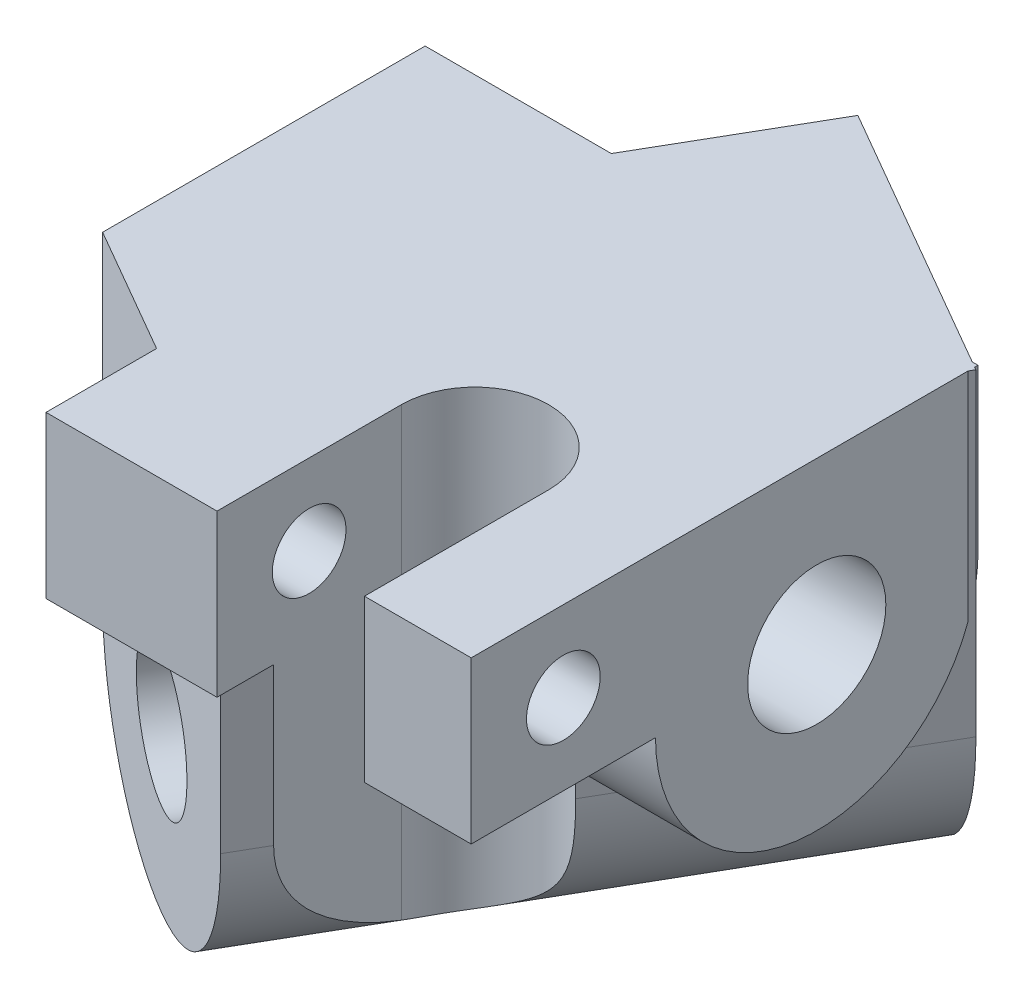
ISO-10303-21;
HEADER;
FILE_DESCRIPTION(('STEP AP214'),'2;1');
FILE_NAME('part.step','',(''),(''),'','','');
FILE_SCHEMA(('AUTOMOTIVE_DESIGN { 1 0 10303 214 1 1 1 1 }'));
ENDSEC;
DATA;
#1=APPLICATION_CONTEXT('core data for automotive mechanical design processes');
#2=APPLICATION_PROTOCOL_DEFINITION('international standard','automotive_design',2000,#1);
#3=PRODUCT_CONTEXT('',#1,'mechanical');
#4=PRODUCT('Part','Part','',(#3));
#5=PRODUCT_RELATED_PRODUCT_CATEGORY('part','',(#4));
#6=PRODUCT_DEFINITION_FORMATION('','',#4);
#7=PRODUCT_DEFINITION_CONTEXT('part definition',#1,'design');
#8=PRODUCT_DEFINITION('design','',#6,#7);
#9=PRODUCT_DEFINITION_SHAPE('','',#8);
#10=(LENGTH_UNIT() NAMED_UNIT(*) SI_UNIT(.MILLI.,.METRE.));
#11=(NAMED_UNIT(*) PLANE_ANGLE_UNIT() SI_UNIT($,.RADIAN.));
#12=(NAMED_UNIT(*) SI_UNIT($,.STERADIAN.) SOLID_ANGLE_UNIT());
#13=UNCERTAINTY_MEASURE_WITH_UNIT(LENGTH_MEASURE(1.E-05),#10,'distance_accuracy_value','');
#14=(GEOMETRIC_REPRESENTATION_CONTEXT(3) GLOBAL_UNCERTAINTY_ASSIGNED_CONTEXT((#13)) GLOBAL_UNIT_ASSIGNED_CONTEXT((#10,
#11,#12)) REPRESENTATION_CONTEXT('',''));
#15=CARTESIAN_POINT('',(0.,0.,0.));
#16=DIRECTION('',(0.,0.,1.));
#17=DIRECTION('',(1.,0.,0.));
#18=AXIS2_PLACEMENT_3D('',#15,#16,#17);
#19=CARTESIAN_POINT('',(30.1554445662278,-17.25,-8.48076211353301));
#20=DIRECTION('',(-0.866025403784436,0.,-0.500000000000004));
#21=DIRECTION('',(-0.500000000000004,0.,0.866025403784436));
#22=AXIS2_PLACEMENT_3D('',#19,#20,#21);
#23=PLANE('',#22);
#24=DIRECTION('',(-0.500000000000004,0.,0.866025403784436));
#25=VECTOR('',#24,1.);
#26=CARTESIAN_POINT('',(30.1554445662278,-17.25,-8.48076211353301));
#27=LINE('',#26,#25);
#28=CARTESIAN_POINT('',(24.0601163962181,-17.25,2.07665596572951));
#29=VERTEX_POINT('',#28);
#30=CARTESIAN_POINT('',(22.207259421637,-17.25,5.28589838486226));
#31=VERTEX_POINT('',#30);
#32=EDGE_CURVE('E425',#29,#31,#27,.T.);
#33=ORIENTED_EDGE('',*,*,#32,.F.);
#34=CARTESIAN_POINT('',(25.2590742770462,-8.75,0.));
#35=DIRECTION('',(0.866025403784436,0.,0.500000000000004));
#36=DIRECTION('',(-0.500000000000004,0.,0.866025403784436));
#37=AXIS2_PLACEMENT_3D('',#34,#35,#36);
#38=ELLIPSE('',#37,10.1036297108185,8.75);
#39=CARTESIAN_POINT('',(22.207259421637,-15.7229318270661,5.28589838486226));
#40=VERTEX_POINT('',#39);
#41=EDGE_CURVE('E429',#40,#29,#38,.T.);
#42=ORIENTED_EDGE('',*,*,#41,.F.);
#43=DIRECTION('',(0.,1.,0.));
#44=VECTOR('',#43,1.);
#45=CARTESIAN_POINT('',(22.207259421637,-26.,5.28589838486226));
#46=LINE('',#45,#44);
#47=EDGE_CURVE('E40',#31,#40,#46,.T.);
#48=ORIENTED_EDGE('',*,*,#47,.F.);
#49=EDGE_LOOP('',(#33,#42,#48));
#50=FACE_BOUND('',#49,.T.);
#51=ADVANCED_FACE('F32',(#50),#23,.F.);
#52=CARTESIAN_POINT('',(30.,-8.75,0.));
#53=DIRECTION('',(1.,0.,0.));
#54=DIRECTION('',(0.,0.,-1.));
#55=AXIS2_PLACEMENT_3D('',#52,#53,#54);
#56=PLANE('',#55);
#57=CARTESIAN_POINT('',(30.,-4.375,13.75));
#58=DIRECTION('',(-1.,0.,0.));
#59=DIRECTION('',(0.,0.,-1.));
#60=AXIS2_PLACEMENT_3D('',#57,#58,#59);
#61=CIRCLE('',#60,2.);
#62=CARTESIAN_POINT('',(30.,-4.375,11.75));
#63=VERTEX_POINT('',#62);
#64=EDGE_CURVE('E196',#63,#63,#61,.T.);
#65=ORIENTED_EDGE('',*,*,#64,.T.);
#66=EDGE_LOOP('',(#65));
#67=FACE_BOUND('',#66,.T.);
#68=CARTESIAN_POINT('',(30.,-8.75,0.));
#69=DIRECTION('',(-1.,0.,0.));
#70=DIRECTION('',(0.,0.,-1.));
#71=AXIS2_PLACEMENT_3D('',#68,#69,#70);
#72=CIRCLE('',#71,3.75);
#73=CARTESIAN_POINT('',(30.,-8.75,-3.75));
#74=VERTEX_POINT('',#73);
#75=EDGE_CURVE('E368',#74,#74,#72,.T.);
#76=ORIENTED_EDGE('',*,*,#75,.T.);
#77=EDGE_LOOP('',(#76));
#78=FACE_BOUND('',#77,.T.);
#79=DIRECTION('',(0.,0.,-1.));
#80=VECTOR('',#79,1.);
#81=CARTESIAN_POINT('',(30.,0.,8.75));
#82=LINE('',#81,#80);
#83=CARTESIAN_POINT('',(30.,0.,18.75));
#84=VERTEX_POINT('',#83);
#85=CARTESIAN_POINT('',(30.,0.,-8.21152422706606));
#86=VERTEX_POINT('',#85);
#87=EDGE_CURVE('E360',#84,#86,#82,.T.);
#88=ORIENTED_EDGE('',*,*,#87,.F.);
#89=DIRECTION('',(0.,1.,0.));
#90=VECTOR('',#89,1.);
#91=CARTESIAN_POINT('',(30.,-8.75,18.75));
#92=LINE('',#91,#90);
#93=CARTESIAN_POINT('',(30.,-8.75,18.75));
#94=VERTEX_POINT('',#93);
#95=EDGE_CURVE('E225',#94,#84,#92,.T.);
#96=ORIENTED_EDGE('',*,*,#95,.F.);
#97=DIRECTION('',(0.,0.,1.));
#98=VECTOR('',#97,1.);
#99=CARTESIAN_POINT('',(30.,-8.75,18.75));
#100=LINE('',#99,#98);
#101=CARTESIAN_POINT('',(30.,-8.75,8.75));
#102=VERTEX_POINT('',#101);
#103=EDGE_CURVE('E217',#102,#94,#100,.T.);
#104=ORIENTED_EDGE('',*,*,#103,.F.);
#105=CARTESIAN_POINT('',(30.,-8.75,0.));
#106=DIRECTION('',(-1.,0.,0.));
#107=DIRECTION('',(0.,0.,-1.));
#108=AXIS2_PLACEMENT_3D('',#105,#106,#107);
#109=CIRCLE('',#108,8.75);
#110=CARTESIAN_POINT('',(30.,-11.772146566318,-8.21152422706604));
#111=VERTEX_POINT('',#110);
#112=EDGE_CURVE('E351',#111,#102,#109,.T.);
#113=ORIENTED_EDGE('',*,*,#112,.F.);
#114=DIRECTION('',(0.,-1.,0.));
#115=VECTOR('',#114,1.);
#116=CARTESIAN_POINT('',(30.,-8.75000000000001,-8.21152422706605));
#117=LINE('',#116,#115);
#118=EDGE_CURVE('E337',#86,#111,#117,.T.);
#119=ORIENTED_EDGE('',*,*,#118,.F.);
#120=EDGE_LOOP('',(#88,#96,#104,#113,#119));
#121=FACE_BOUND('',#120,.T.);
#122=ADVANCED_FACE('F311',(#67,#78,#121),#56,.T.);
#123=CARTESIAN_POINT('',(30.,0.,-8.75));
#124=DIRECTION('',(0.,0.,1.));
#125=DIRECTION('',(1.,0.,0.));
#126=AXIS2_PLACEMENT_3D('',#123,#124,#125);
#127=PLANE('',#126);
#128=DIRECTION('',(0.,-1.,0.));
#129=VECTOR('',#128,1.);
#130=CARTESIAN_POINT('',(10.1036297108186,0.,-8.75));
#131=LINE('',#130,#129);
#132=CARTESIAN_POINT('',(10.1036297108186,0.,-8.75));
#133=VERTEX_POINT('',#132);
#134=CARTESIAN_POINT('',(10.1036297108186,-8.75,-8.75));
#135=VERTEX_POINT('',#134);
#136=EDGE_CURVE('E434',#133,#135,#131,.T.);
#137=ORIENTED_EDGE('',*,*,#136,.T.);
#138=DIRECTION('',(-1.,0.,0.));
#139=VECTOR('',#138,1.);
#140=CARTESIAN_POINT('',(30.,-8.75,-8.75));
#141=LINE('',#140,#139);
#142=CARTESIAN_POINT('',(0.,-8.75,-8.75));
#143=VERTEX_POINT('',#142);
#144=EDGE_CURVE('E378',#135,#143,#141,.T.);
#145=ORIENTED_EDGE('',*,*,#144,.T.);
#146=DIRECTION('',(0.,-1.,0.));
#147=VECTOR('',#146,1.);
#148=CARTESIAN_POINT('',(0.,0.,-8.75));
#149=LINE('',#148,#147);
#150=CARTESIAN_POINT('',(0.,0.,-8.75));
#151=VERTEX_POINT('',#150);
#152=EDGE_CURVE('E370',#151,#143,#149,.T.);
#153=ORIENTED_EDGE('',*,*,#152,.F.);
#154=DIRECTION('',(-1.,0.,0.));
#155=VECTOR('',#154,1.);
#156=CARTESIAN_POINT('',(30.,0.,-8.75));
#157=LINE('',#156,#155);
#158=EDGE_CURVE('E381',#133,#151,#157,.T.);
#159=ORIENTED_EDGE('',*,*,#158,.F.);
#160=EDGE_LOOP('',(#137,#145,#153,#159));
#161=FACE_BOUND('',#160,.T.);
#162=ADVANCED_FACE('F297',(#161),#127,.F.);
#163=CARTESIAN_POINT('',(30.,-8.75,0.));
#164=DIRECTION('',(-1.,0.,0.));
#165=DIRECTION('',(0.,0.,1.));
#166=AXIS2_PLACEMENT_3D('',#163,#164,#165);
#167=CYLINDRICAL_SURFACE('',#166,8.75);
#168=CARTESIAN_POINT('',(5.05181485540928,-8.75,0.));
#169=DIRECTION('',(-0.866025403784436,0.,-0.500000000000004));
#170=DIRECTION('',(-0.500000000000004,0.,0.866025403784436));
#171=AXIS2_PLACEMENT_3D('',#168,#169,#170);
#172=ELLIPSE('',#171,10.1036297108185,8.75);
#173=CARTESIAN_POINT('',(6.25077273623748,-17.25,-2.07665596572953));
#174=VERTEX_POINT('',#173);
#175=EDGE_CURVE('E433',#135,#174,#172,.T.);
#176=ORIENTED_EDGE('',*,*,#175,.T.);
#177=CARTESIAN_POINT('',(6.25077273623748,-17.25,-2.07665596572953));
#178=CARTESIAN_POINT('',(6.17045305423663,-17.2839955158162,-1.93752118965594));
#179=CARTESIAN_POINT('',(6.08992669708827,-17.3145407726905,-1.79766573743263));
#180=CARTESIAN_POINT('',(5.92845414899194,-17.3687042069313,-1.51686167601603));
#181=CARTESIAN_POINT('',(5.84750796197914,-17.3923224491074,-1.37591307706296));
#182=CARTESIAN_POINT('',(5.68514484693701,-17.4326165812872,-1.09319356352859));
#183=CARTESIAN_POINT('',(5.60372769259806,-17.4492887932685,-0.95142225349095));
#184=CARTESIAN_POINT('',(5.44052248566032,-17.4756709734203,-0.667459190548528));
#185=CARTESIAN_POINT('',(5.35873443607839,-17.4853809981191,-0.525267441066848));
#186=CARTESIAN_POINT('',(5.11573925489823,-17.5038639870459,-0.10337892787786));
#187=CARTESIAN_POINT('',(4.95408084797536,-17.5026841834947,0.176553909262585));
#188=CARTESIAN_POINT('',(4.63084663215437,-17.4735677881277,0.734828019402746));
#189=CARTESIAN_POINT('',(4.46927083873285,-17.4456487685698,1.01317021688613));
#190=CARTESIAN_POINT('',(4.23223408822682,-17.3847720872609,1.42159042234583));
#191=CARTESIAN_POINT('',(4.15605832048719,-17.3621389081463,1.55285602570154));
#192=CARTESIAN_POINT('',(4.00405358423578,-17.3107093865198,1.8151228385504));
#193=CARTESIAN_POINT('',(3.92822735199661,-17.2818879476154,1.94612071065994));
#194=CARTESIAN_POINT('',(3.85285697458108,-17.25,2.07665596572953));
#195=B_SPLINE_CURVE_WITH_KNOTS('',3,(#177,#178,#179,#180,#181,#182,#183,#184,#185,#186,#187,
#188,#189,#190,#191,#192,#193,#194),.UNSPECIFIED.,.F.,.F.,(4,2,2,2,2,2,2,2,4),(0.,
0.492592446399339,0.985180283919886,1.47802862326541,1.97087296096945,2.93946951707011,
3.90742997531448,4.36766174258732,4.8297964680422),.UNSPECIFIED.);
#196=CARTESIAN_POINT('',(3.85285697458108,-17.25,2.07665596572953));
#197=VERTEX_POINT('',#196);
#198=EDGE_CURVE('E284',#174,#197,#195,.T.);
#199=ORIENTED_EDGE('',*,*,#198,.T.);
#200=CARTESIAN_POINT('',(0.,-8.75,8.75));
#201=VERTEX_POINT('',#200);
#202=EDGE_CURVE('E347',#197,#201,#172,.T.);
#203=ORIENTED_EDGE('',*,*,#202,.T.);
#204=CARTESIAN_POINT('',(0.,-8.75,0.));
#205=DIRECTION('',(-1.,0.,0.));
#206=DIRECTION('',(0.,0.,-1.));
#207=AXIS2_PLACEMENT_3D('',#204,#205,#206);
#208=CIRCLE('',#207,8.75);
#209=EDGE_CURVE('E373',#143,#201,#208,.T.);
#210=ORIENTED_EDGE('',*,*,#209,.F.);
#211=ORIENTED_EDGE('',*,*,#144,.F.);
#212=EDGE_LOOP('',(#176,#199,#203,#210,#211));
#213=FACE_BOUND('',#212,.T.);
#214=ADVANCED_FACE('F292',(#213),#167,.T.);
#215=ORIENTED_EDGE('',*,*,#41,.T.);
#216=CARTESIAN_POINT('',(24.060116396218,-17.25,2.07665596572952));
#217=CARTESIAN_POINT('',(24.1404360782189,-17.2839955158162,1.93752118965593));
#218=CARTESIAN_POINT('',(24.2209624353673,-17.3145407726905,1.79766573743262));
#219=CARTESIAN_POINT('',(24.3824349834636,-17.3687042069313,1.51686167601602));
#220=CARTESIAN_POINT('',(24.4633811704764,-17.3923224491074,1.37591307706295));
#221=CARTESIAN_POINT('',(24.6257442855185,-17.4326165812872,1.09319356352858));
#222=CARTESIAN_POINT('',(24.7071614398575,-17.4492887932685,0.951422253490937));
#223=CARTESIAN_POINT('',(24.8703666467952,-17.4756709734203,0.667459190548515));
#224=CARTESIAN_POINT('',(24.9521546963771,-17.4853809981191,0.525267441066837));
#225=CARTESIAN_POINT('',(25.1951498775573,-17.5038639870459,0.103378927877851));
#226=CARTESIAN_POINT('',(25.3568082844802,-17.5026841834947,-0.176553909262594));
#227=CARTESIAN_POINT('',(25.6800425003012,-17.4735677881277,-0.734828019402755));
#228=CARTESIAN_POINT('',(25.8416182937227,-17.4456487685698,-1.01317021688614));
#229=CARTESIAN_POINT('',(26.0786550442287,-17.3847720872609,-1.42159042234583));
#230=CARTESIAN_POINT('',(26.1548308119683,-17.3621389081463,-1.55285602570154));
#231=CARTESIAN_POINT('',(26.3068355482197,-17.3107093865198,-1.8151228385504));
#232=CARTESIAN_POINT('',(26.3826617804589,-17.2818879476154,-1.94612071065993));
#233=CARTESIAN_POINT('',(26.4580321578744,-17.25,-2.07665596572952));
#234=B_SPLINE_CURVE_WITH_KNOTS('',3,(#216,#217,#218,#219,#220,#221,#222,#223,#224,#225,#226,
#227,#228,#229,#230,#231,#232,#233),.UNSPECIFIED.,.F.,.F.,(4,2,2,2,2,2,2,2,4),(0.,
0.49259244639934,0.985180283919886,1.47802862326541,1.97087296096945,2.9394695170701,
3.90742997531448,4.36766174258731,4.82979646804217),.UNSPECIFIED.);
#235=CARTESIAN_POINT('',(26.4580321578744,-17.25,-2.07665596572952));
#236=VERTEX_POINT('',#235);
#237=EDGE_CURVE('E278',#29,#236,#234,.T.);
#238=ORIENTED_EDGE('',*,*,#237,.T.);
#239=EDGE_CURVE('E340',#236,#111,#38,.T.);
#240=ORIENTED_EDGE('',*,*,#239,.T.);
#241=ORIENTED_EDGE('',*,*,#112,.T.);
#242=DIRECTION('',(-1.,0.,0.));
#243=VECTOR('',#242,1.);
#244=CARTESIAN_POINT('',(30.,-8.75,8.75));
#245=LINE('',#244,#243);
#246=CARTESIAN_POINT('',(24.2072594216369,-8.75,8.75));
#247=VERTEX_POINT('',#246);
#248=EDGE_CURVE('E359',#102,#247,#245,.T.);
#249=ORIENTED_EDGE('',*,*,#248,.T.);
#250=CARTESIAN_POINT('',(20.1485029781668,-16.0981902508714,4.75043156323701));
#251=CARTESIAN_POINT('',(20.2442905484469,-16.0990964128763,4.74900732212532));
#252=CARTESIAN_POINT('',(20.340147948157,-16.0977846801699,4.7510573078996));
#253=CARTESIAN_POINT('',(20.5312961580327,-16.0907040057593,4.76200214444356));
#254=CARTESIAN_POINT('',(20.62658702579,-16.0849355251989,4.77089628704157));
#255=CARTESIAN_POINT('',(20.8157295258631,-16.0689359085176,4.79540143297364));
#256=CARTESIAN_POINT('',(20.9095836238424,-16.0587135869906,4.81099916840711));
#257=CARTESIAN_POINT('',(21.0953686233684,-16.033766116063,4.84868696111031));
#258=CARTESIAN_POINT('',(21.1872995379011,-16.0190409970775,4.87077697452626));
#259=CARTESIAN_POINT('',(21.3685994212124,-15.9850375665874,4.92114342029558));
#260=CARTESIAN_POINT('',(21.4579680864919,-15.9657587181704,4.94942058212212));
#261=CARTESIAN_POINT('',(21.6335520283011,-15.922594360825,5.01176888879183));
#262=CARTESIAN_POINT('',(21.7197661273677,-15.898707152247,5.04584217080266));
#263=CARTESIAN_POINT('',(21.8883988079629,-15.8463115266805,5.11926692057997));
#264=CARTESIAN_POINT('',(21.9708194290293,-15.8178056310626,5.15861550651331));
#265=CARTESIAN_POINT('',(22.1314500792258,-15.7561446364365,5.24205388875792));
#266=CARTESIAN_POINT('',(22.2096585272862,-15.7229878082684,5.28614544702039));
#267=CARTESIAN_POINT('',(22.3623878181195,-15.6516023087653,5.37901978809682));
#268=CARTESIAN_POINT('',(22.4368490599915,-15.6133144581029,5.42785513484066));
#269=CARTESIAN_POINT('',(22.5806815743442,-15.532071262806,5.52903532449174));
#270=CARTESIAN_POINT('',(22.6500510161901,-15.4891142531241,5.58138141678472));
#271=CARTESIAN_POINT('',(22.8501243072632,-15.3533953417673,5.74258791053661));
#272=CARTESIAN_POINT('',(22.9728849313336,-15.2537427437506,5.85567365963137));
#273=CARTESIAN_POINT('',(23.2057052238415,-15.0286627266507,6.09674370316369));
#274=CARTESIAN_POINT('',(23.3138600417606,-14.9017811191412,6.22518494452467));
#275=CARTESIAN_POINT('',(23.5059358019272,-14.6307178384615,6.48185911955175));
#276=CARTESIAN_POINT('',(23.5898470933866,-14.4865293080448,6.61009195011167));
#277=CARTESIAN_POINT('',(23.7198716432647,-14.2175353124912,6.8331524507467));
#278=CARTESIAN_POINT('',(23.7702412238995,-14.0956033926039,6.92903900060324));
#279=CARTESIAN_POINT('',(23.8597585451508,-13.8440902187252,7.11598849286189));
#280=CARTESIAN_POINT('',(23.8989012030552,-13.7145055320458,7.20704923533813));
#281=CARTESIAN_POINT('',(23.9676996621239,-13.4485035997608,7.38323022514537));
#282=CARTESIAN_POINT('',(23.9973320520409,-13.3120704348112,7.46833541555332));
#283=CARTESIAN_POINT('',(24.0486423087337,-13.0335826501128,7.63147986516758));
#284=CARTESIAN_POINT('',(24.0703178953492,-12.8915264318802,7.70951709410827));
#285=CARTESIAN_POINT('',(24.1144027988967,-12.5467185308072,7.88657843770023));
#286=CARTESIAN_POINT('',(24.1338506380246,-12.3417505595027,7.98203912912937));
#287=CARTESIAN_POINT('',(24.1640542283199,-11.9244550570637,8.15699620768429));
#288=CARTESIAN_POINT('',(24.174806091652,-11.7121242783255,8.23648544229791));
#289=CARTESIAN_POINT('',(24.1906393837072,-11.2817951419793,8.37877409245609));
#290=CARTESIAN_POINT('',(24.195721913766,-11.0637978935737,8.44157674776165));
#291=CARTESIAN_POINT('',(24.2026277636208,-10.6236455217183,8.55004817860867));
#292=CARTESIAN_POINT('',(24.2044523841605,-10.4014920934668,8.59572378648859));
#293=CARTESIAN_POINT('',(24.2066875232759,-9.94169498564568,8.67177305051995));
#294=CARTESIAN_POINT('',(24.2070127726699,-9.70388260960126,8.70114204801667));
#295=CARTESIAN_POINT('',(24.2072217138656,-9.34637171643065,8.73046961533928));
#296=CARTESIAN_POINT('',(24.2072450305433,-9.22723348079246,8.7377911513655));
#297=CARTESIAN_POINT('',(24.2072603946276,-8.98873497340255,8.74755669108357));
#298=CARTESIAN_POINT('',(24.2072524361939,-8.86937466434113,8.74999978365514));
#299=CARTESIAN_POINT('',(24.2072594216369,-8.75,8.75));
#300=B_SPLINE_CURVE_WITH_KNOTS('',3,(#250,#251,#252,#253,#254,#255,#256,#257,#258,#259,#260,
#261,#262,#263,#264,#265,#266,#267,#268,#269,#270,#271,#272,#273,#274,#275,#276,#277,#278,#279,
#280,#281,#282,#283,#284,#285,#286,#287,#288,#289,#290,#291,#292,#293,#294,#295,#296,#297,#298,
#299),.UNSPECIFIED.,.F.,.F.,(4,2,2,2,2,2,2,2,2,2,2,2,2,2,2,2,2,2,2,2,2,2,2,2,4),(0.,
0.287315853760752,0.574601982663118,0.861322108208879,1.14804029707345,1.4347923086337,
1.72165028259402,2.00835218333389,2.29516096025176,2.58561999366466,2.87618294829894,
3.45696385425701,4.08603684366191,4.71535990855098,5.20398572847379,5.69283241376325,
6.18287341429806,6.67305473517355,7.35290874207197,8.03306653333264,8.71309217278946,
9.39284624641988,10.1108166450022,10.4688201122941,10.8268904356908),.UNSPECIFIED.);
#301=EDGE_CURVE('E254',#40,#247,#300,.T.);
#302=ORIENTED_EDGE('',*,*,#301,.F.);
#303=EDGE_LOOP('',(#215,#238,#240,#241,#249,#302));
#304=FACE_BOUND('',#303,.T.);
#305=ADVANCED_FACE('F296',(#304),#167,.T.);
#306=CARTESIAN_POINT('',(30.,-8.75,-8.75));
#307=VERTEX_POINT('',#306);
#308=CARTESIAN_POINT('',(29.6891108675445,-8.75,-8.75));
#309=VERTEX_POINT('',#308);
#310=EDGE_CURVE('E379',#307,#309,#141,.T.);
#311=ORIENTED_EDGE('',*,*,#310,.F.);
#312=CARTESIAN_POINT('',(30.,-10.5132048447515,-8.57050807568867));
#313=VERTEX_POINT('',#312);
#314=EDGE_CURVE('E355',#307,#313,#109,.T.);
#315=ORIENTED_EDGE('',*,*,#314,.T.);
#316=CARTESIAN_POINT('',(44.844555433772,-8.75,0.));
#317=DIRECTION('',(-0.500000000000004,0.,0.866025403784436));
#318=DIRECTION('',(-0.866025403784436,0.,-0.500000000000004));
#319=AXIS2_PLACEMENT_3D('',#316,#317,#318);
#320=ELLIPSE('',#319,17.4999999999999,8.75);
#321=EDGE_CURVE('E290',#309,#313,#320,.T.);
#322=ORIENTED_EDGE('',*,*,#321,.F.);
#323=EDGE_LOOP('',(#311,#315,#322));
#324=FACE_BOUND('',#323,.T.);
#325=ADVANCED_FACE('F299',(#324),#167,.T.);
#326=CARTESIAN_POINT('',(30.,-8.75,0.));
#327=DIRECTION('',(-1.,0.,0.));
#328=DIRECTION('',(0.,0.,1.));
#329=AXIS2_PLACEMENT_3D('',#326,#327,#328);
#330=CYLINDRICAL_SURFACE('',#329,3.75);
#331=ORIENTED_EDGE('',*,*,#75,.F.);
#332=EDGE_LOOP('',(#331));
#333=FACE_BOUND('',#332,.T.);
#334=CARTESIAN_POINT('',(0.,-8.75,0.));
#335=DIRECTION('',(-1.,0.,0.));
#336=DIRECTION('',(0.,0.,-1.));
#337=AXIS2_PLACEMENT_3D('',#334,#335,#336);
#338=CIRCLE('',#337,3.75);
#339=CARTESIAN_POINT('',(0.,-8.75,-3.75));
#340=VERTEX_POINT('',#339);
#341=EDGE_CURVE('E440',#340,#340,#338,.T.);
#342=ORIENTED_EDGE('',*,*,#341,.T.);
#343=EDGE_LOOP('',(#342));
#344=FACE_BOUND('',#343,.T.);
#345=ADVANCED_FACE('F467',(#333,#344),#330,.F.);
#346=DIRECTION('',(0.,-1.,0.));
#347=VECTOR('',#346,1.);
#348=CARTESIAN_POINT('',(30.,-8.75,-8.57050807568867));
#349=LINE('',#348,#347);
#350=CARTESIAN_POINT('',(30.,0.,-8.57050807568867));
#351=VERTEX_POINT('',#350);
#352=EDGE_CURVE('E438',#351,#313,#349,.T.);
#353=ORIENTED_EDGE('',*,*,#352,.T.);
#354=ORIENTED_EDGE('',*,*,#314,.F.);
#355=DIRECTION('',(0.,-1.,0.));
#356=VECTOR('',#355,1.);
#357=CARTESIAN_POINT('',(30.,0.,-8.75));
#358=LINE('',#357,#356);
#359=CARTESIAN_POINT('',(30.,0.,-8.75));
#360=VERTEX_POINT('',#359);
#361=EDGE_CURVE('E356',#360,#307,#358,.T.);
#362=ORIENTED_EDGE('',*,*,#361,.F.);
#363=EDGE_CURVE('E376',#351,#360,#82,.T.);
#364=ORIENTED_EDGE('',*,*,#363,.F.);
#365=EDGE_LOOP('',(#353,#354,#362,#364));
#366=FACE_BOUND('',#365,.T.);
#367=ADVANCED_FACE('F321',(#366),#56,.T.);
#368=CARTESIAN_POINT('',(0.,-8.75,0.));
#369=DIRECTION('',(1.,0.,0.));
#370=DIRECTION('',(0.,0.,-1.));
#371=AXIS2_PLACEMENT_3D('',#368,#369,#370);
#372=PLANE('',#371);
#373=DIRECTION('',(0.,1.,0.));
#374=VECTOR('',#373,1.);
#375=CARTESIAN_POINT('',(0.,-8.75,8.75));
#376=LINE('',#375,#374);
#377=CARTESIAN_POINT('',(0.,0.,8.75));
#378=VERTEX_POINT('',#377);
#379=EDGE_CURVE('E364',#201,#378,#376,.T.);
#380=ORIENTED_EDGE('',*,*,#379,.T.);
#381=DIRECTION('',(0.,0.,-1.));
#382=VECTOR('',#381,1.);
#383=CARTESIAN_POINT('',(0.,0.,8.75));
#384=LINE('',#383,#382);
#385=EDGE_CURVE('E367',#378,#151,#384,.T.);
#386=ORIENTED_EDGE('',*,*,#385,.T.);
#387=ORIENTED_EDGE('',*,*,#152,.T.);
#388=ORIENTED_EDGE('',*,*,#209,.T.);
#389=EDGE_LOOP('',(#380,#386,#387,#388));
#390=FACE_BOUND('',#389,.T.);
#391=ORIENTED_EDGE('',*,*,#341,.F.);
#392=EDGE_LOOP('',(#391));
#393=FACE_BOUND('',#392,.T.);
#394=ADVANCED_FACE('F300',(#390,#393),#372,.F.);
#395=CARTESIAN_POINT('',(30.,0.,8.75));
#396=DIRECTION('',(0.,-1.,0.));
#397=DIRECTION('',(0.,0.,1.));
#398=AXIS2_PLACEMENT_3D('',#395,#396,#397);
#399=PLANE('',#398);
#400=DIRECTION('',(0.,0.,-1.));
#401=VECTOR('',#400,1.);
#402=CARTESIAN_POINT('',(16.2072594216369,0.,15.6782032302754));
#403=LINE('',#402,#401);
#404=CARTESIAN_POINT('',(16.2072594216369,0.,18.75));
#405=VERTEX_POINT('',#404);
#406=CARTESIAN_POINT('',(16.2072594216369,0.,8.75));
#407=VERTEX_POINT('',#406);
#408=EDGE_CURVE('E237',#405,#407,#403,.T.);
#409=ORIENTED_EDGE('',*,*,#408,.T.);
#410=CARTESIAN_POINT('',(20.2072594216369,0.,8.75));
#411=DIRECTION('',(0.,-1.,0.));
#412=DIRECTION('',(0.,0.,-1.));
#413=AXIS2_PLACEMENT_3D('',#410,#411,#412);
#414=CIRCLE('',#413,4.);
#415=CARTESIAN_POINT('',(24.2072594216369,0.,8.75));
#416=VERTEX_POINT('',#415);
#417=EDGE_CURVE('E232',#407,#416,#414,.T.);
#418=ORIENTED_EDGE('',*,*,#417,.T.);
#419=DIRECTION('',(0.,0.,-1.));
#420=VECTOR('',#419,1.);
#421=CARTESIAN_POINT('',(24.2072594216369,0.,8.75));
#422=LINE('',#421,#420);
#423=CARTESIAN_POINT('',(24.2072594216369,0.,18.75));
#424=VERTEX_POINT('',#423);
#425=EDGE_CURVE('E221',#424,#416,#422,.T.);
#426=ORIENTED_EDGE('',*,*,#425,.F.);
#427=DIRECTION('',(-1.,0.,0.));
#428=VECTOR('',#427,1.);
#429=CARTESIAN_POINT('',(24.2072594216369,0.,18.75));
#430=LINE('',#429,#428);
#431=EDGE_CURVE('E216',#84,#424,#430,.T.);
#432=ORIENTED_EDGE('',*,*,#431,.F.);
#433=ORIENTED_EDGE('',*,*,#87,.T.);
#434=DIRECTION('',(-0.500000000000004,0.,0.866025403784436));
#435=VECTOR('',#434,1.);
#436=CARTESIAN_POINT('',(30.1554445662277,0.,-8.48076211353302));
#437=LINE('',#436,#435);
#438=CARTESIAN_POINT('',(30.1554445662277,0.,-8.48076211353302));
#439=VERTEX_POINT('',#438);
#440=EDGE_CURVE('E343',#439,#86,#437,.T.);
#441=ORIENTED_EDGE('',*,*,#440,.F.);
#442=DIRECTION('',(-0.866025403784436,0.,-0.500000000000004));
#443=VECTOR('',#442,1.);
#444=CARTESIAN_POINT('',(30.1554445662277,0.,-8.48076211353302));
#445=LINE('',#444,#443);
#446=EDGE_CURVE('E447',#439,#351,#445,.T.);
#447=ORIENTED_EDGE('',*,*,#446,.T.);
#448=ORIENTED_EDGE('',*,*,#363,.T.);
#449=CARTESIAN_POINT('',(29.6891108675445,0.,-8.75));
#450=VERTEX_POINT('',#449);
#451=EDGE_CURVE('E382',#360,#450,#157,.T.);
#452=ORIENTED_EDGE('',*,*,#451,.T.);
#453=CARTESIAN_POINT('',(15.0000000000001,0.,-17.2307621135331));
#454=VERTEX_POINT('',#453);
#455=EDGE_CURVE('E419',#450,#454,#445,.T.);
#456=ORIENTED_EDGE('',*,*,#455,.T.);
#457=DIRECTION('',(-0.500000000000004,0.,0.866025403784436));
#458=VECTOR('',#457,1.);
#459=CARTESIAN_POINT('',(15.0000000000001,0.,-17.2307621135331));
#460=LINE('',#459,#458);
#461=EDGE_CURVE('E392',#454,#133,#460,.T.);
#462=ORIENTED_EDGE('',*,*,#461,.T.);
#463=ORIENTED_EDGE('',*,*,#158,.T.);
#464=ORIENTED_EDGE('',*,*,#385,.F.);
#465=DIRECTION('',(-0.866025403784436,0.,-0.500000000000004));
#466=VECTOR('',#465,1.);
#467=CARTESIAN_POINT('',(15.1554445662276,0.,17.5000000000001));
#468=LINE('',#467,#466);
#469=CARTESIAN_POINT('',(6.92820323027553,0.,12.7500000000001));
#470=VERTEX_POINT('',#469);
#471=EDGE_CURVE('E404',#470,#378,#468,.T.);
#472=ORIENTED_EDGE('',*,*,#471,.F.);
#473=DIRECTION('',(0.,0.,-1.));
#474=VECTOR('',#473,1.);
#475=CARTESIAN_POINT('',(6.92820323027535,0.,18.75));
#476=LINE('',#475,#474);
#477=CARTESIAN_POINT('',(6.92820323027535,0.,18.75));
#478=VERTEX_POINT('',#477);
#479=EDGE_CURVE('E491',#478,#470,#476,.T.);
#480=ORIENTED_EDGE('',*,*,#479,.F.);
#481=DIRECTION('',(-1.,0.,0.));
#482=VECTOR('',#481,1.);
#483=CARTESIAN_POINT('',(16.2072594216369,0.,18.75));
#484=LINE('',#483,#482);
#485=EDGE_CURVE('E499',#405,#478,#484,.T.);
#486=ORIENTED_EDGE('',*,*,#485,.F.);
#487=EDGE_LOOP('',(#409,#418,#426,#432,#433,#441,#447,#448,#452,#456,#462,#463,#464,#472,#480,#486));
#488=FACE_BOUND('',#487,.T.);
#489=ADVANCED_FACE('F34',(#488),#399,.F.);
#490=ORIENTED_EDGE('',*,*,#451,.F.);
#491=ORIENTED_EDGE('',*,*,#361,.T.);
#492=ORIENTED_EDGE('',*,*,#310,.T.);
#493=DIRECTION('',(0.,-1.,0.));
#494=VECTOR('',#493,1.);
#495=CARTESIAN_POINT('',(29.6891108675445,0.,-8.75));
#496=LINE('',#495,#494);
#497=EDGE_CURVE('E436',#450,#309,#496,.T.);
#498=ORIENTED_EDGE('',*,*,#497,.F.);
#499=EDGE_LOOP('',(#490,#491,#492,#498));
#500=FACE_BOUND('',#499,.T.);
#501=ADVANCED_FACE('F270',(#500),#127,.F.);
#502=CARTESIAN_POINT('',(22.5777222831139,-17.25,-12.855762113533));
#503=DIRECTION('',(-0.500000000000004,0.,0.866025403784436));
#504=DIRECTION('',(0.866025403784436,0.,0.500000000000004));
#505=AXIS2_PLACEMENT_3D('',#502,#503,#504);
#506=CYLINDRICAL_SURFACE('',#505,8.75);
#507=CARTESIAN_POINT('',(16.2072594216369,-17.25,-1.8217967697244));
#508=DIRECTION('',(1.,0.,0.));
#509=DIRECTION('',(0.,0.,1.));
#510=AXIS2_PLACEMENT_3D('',#507,#508,#509);
#511=ELLIPSE('',#510,17.4999999999999,8.75);
#512=CARTESIAN_POINT('',(16.207259421637,-17.25,15.6782032302754));
#513=VERTEX_POINT('',#512);
#514=CARTESIAN_POINT('',(16.2072594216369,-24.2229318270661,8.75));
#515=VERTEX_POINT('',#514);
#516=EDGE_CURVE('E243',#513,#515,#511,.T.);
#517=ORIENTED_EDGE('',*,*,#516,.F.);
#518=CARTESIAN_POINT('',(15.1554445662276,-17.25,17.5000000000001));
#519=VERTEX_POINT('',#518);
#520=EDGE_CURVE('E421',#513,#519,#27,.T.);
#521=ORIENTED_EDGE('',*,*,#520,.T.);
#522=CARTESIAN_POINT('',(7.57772228311382,-17.25,13.125));
#523=DIRECTION('',(-0.500000000000004,0.,0.866025403784436));
#524=DIRECTION('',(-0.866025403784436,0.,-0.500000000000004));
#525=AXIS2_PLACEMENT_3D('',#522,#523,#524);
#526=CIRCLE('',#525,8.75);
#527=CARTESIAN_POINT('',(0.,-17.25,8.75000000000001));
#528=VERTEX_POINT('',#527);
#529=EDGE_CURVE('E408',#528,#519,#526,.T.);
#530=ORIENTED_EDGE('',*,*,#529,.F.);
#531=DIRECTION('',(-0.500000000000004,0.,0.866025403784436));
#532=VECTOR('',#531,1.);
#533=CARTESIAN_POINT('',(15.0000000000001,-17.25,-17.2307621135331));
#534=LINE('',#533,#532);
#535=EDGE_CURVE('E424',#197,#528,#534,.T.);
#536=ORIENTED_EDGE('',*,*,#535,.F.);
#537=ORIENTED_EDGE('',*,*,#198,.F.);
#538=CARTESIAN_POINT('',(15.0000000000001,-17.25,-17.2307621135331));
#539=VERTEX_POINT('',#538);
#540=EDGE_CURVE('E426',#539,#174,#534,.T.);
#541=ORIENTED_EDGE('',*,*,#540,.F.);
#542=CARTESIAN_POINT('',(22.5777222831139,-17.25,-12.855762113533));
#543=DIRECTION('',(-0.500000000000004,0.,0.866025403784436));
#544=DIRECTION('',(-0.866025403784436,0.,-0.500000000000004));
#545=AXIS2_PLACEMENT_3D('',#542,#543,#544);
#546=CIRCLE('',#545,8.75);
#547=CARTESIAN_POINT('',(30.1554445662278,-17.25,-8.48076211353301));
#548=VERTEX_POINT('',#547);
#549=EDGE_CURVE('E461',#539,#548,#546,.T.);
#550=ORIENTED_EDGE('',*,*,#549,.T.);
#551=EDGE_CURVE('E422',#548,#236,#27,.T.);
#552=ORIENTED_EDGE('',*,*,#551,.T.);
#553=ORIENTED_EDGE('',*,*,#237,.F.);
#554=ORIENTED_EDGE('',*,*,#32,.T.);
#555=CARTESIAN_POINT('',(16.2072594216369,-24.2229318270661,8.75));
#556=CARTESIAN_POINT('',(16.2072416900731,-24.2569234332014,8.66034030331076));
#557=CARTESIAN_POINT('',(16.2102735481982,-24.2885777785958,8.56978636666348));
#558=CARTESIAN_POINT('',(16.2226684522539,-24.3472271086901,8.38759858216394));
#559=CARTESIAN_POINT('',(16.2320322434017,-24.3742215444869,8.29596460844751));
#560=CARTESIAN_POINT('',(16.2573212758354,-24.4235545921625,8.11236026402275));
#561=CARTESIAN_POINT('',(16.2732455521865,-24.4458938880052,8.02038994475594));
#562=CARTESIAN_POINT('',(16.311756837031,-24.485961376223,7.83684650071917));
#563=CARTESIAN_POINT('',(16.334343384323,-24.5036898876237,7.74527334890008));
#564=CARTESIAN_POINT('',(16.3862191245825,-24.5346045742314,7.56314367547686));
#565=CARTESIAN_POINT('',(16.4155162516385,-24.5477853258999,7.47258849146888));
#566=CARTESIAN_POINT('',(16.4807189953254,-24.5696269989561,7.2932915831025));
#567=CARTESIAN_POINT('',(16.5166270786038,-24.5782862286541,7.20455054940754));
#568=CARTESIAN_POINT('',(16.5948261284263,-24.5911086682576,7.02968272299817));
#569=CARTESIAN_POINT('',(16.637111635493,-24.5952756991446,6.94355376920454));
#570=CARTESIAN_POINT('',(16.7278314827624,-24.5991468429706,6.77445177041683));
#571=CARTESIAN_POINT('',(16.7762680770941,-24.5988493151196,6.69147989692709));
#572=CARTESIAN_POINT('',(16.8781805111592,-24.5938223936971,6.53050046325465));
#573=CARTESIAN_POINT('',(16.9315738955166,-24.5891567746854,6.45243868351909));
#574=CARTESIAN_POINT('',(17.0435742677627,-24.5754614702348,6.3005090472685));
#575=CARTESIAN_POINT('',(17.1021831419838,-24.566430200555,6.22664272411549));
#576=CARTESIAN_POINT('',(17.2240920742273,-24.5439686437521,6.08362804036619));
#577=CARTESIAN_POINT('',(17.2873911132268,-24.5305393100319,6.01447866116297));
#578=CARTESIAN_POINT('',(17.4181564195855,-24.4992292623076,5.88126879478766));
#579=CARTESIAN_POINT('',(17.4856242155284,-24.4813469081167,5.81721019420273));
#580=CARTESIAN_POINT('',(17.6241892437764,-24.4410565497144,5.69445942009521));
#581=CARTESIAN_POINT('',(17.6952917476368,-24.4186418243987,5.63577540661964));
#582=CARTESIAN_POINT('',(17.8403854327411,-24.3692576971032,5.5241217527577));
#583=CARTESIAN_POINT('',(17.9143776432015,-24.3422866607321,5.47115417412333));
#584=CARTESIAN_POINT('',(18.0644757206264,-24.2837944790146,5.37115315072109));
#585=CARTESIAN_POINT('',(18.1405804458933,-24.2522757542125,5.32411657393031));
#586=CARTESIAN_POINT('',(18.2942377208551,-24.1846807881664,5.23599995964049));
#587=CARTESIAN_POINT('',(18.3717907989317,-24.1486028548364,5.19492214587271));
#588=CARTESIAN_POINT('',(18.5299746594293,-24.0707736835929,5.11754903707357));
#589=CARTESIAN_POINT('',(18.610627057986,-24.0288827409844,5.08143830558921));
#590=CARTESIAN_POINT('',(18.7719065972825,-23.9404248751761,5.01538225385892));
#591=CARTESIAN_POINT('',(18.8525337182879,-23.8938562635429,4.98543917184739));
#592=CARTESIAN_POINT('',(19.0932382548884,-23.7473508926881,4.90454220916992));
#593=CARTESIAN_POINT('',(19.2522394416163,-23.6405657030815,4.86247279259423));
#594=CARTESIAN_POINT('',(19.5773058886729,-23.3992843243075,4.79609148185935));
#595=CARTESIAN_POINT('',(19.7425321754097,-23.2630968434647,4.77392839311018));
#596=CARTESIAN_POINT('',(20.0588108469365,-22.9736132342283,4.74960525613952));
#597=CARTESIAN_POINT('',(20.2098563199326,-22.8203088418498,4.74745491263084));
#598=CARTESIAN_POINT('',(20.4664979757411,-22.531864973938,4.75677972155505));
#599=CARTESIAN_POINT('',(20.5751221629107,-22.3992819606825,4.76559893152575));
#600=CARTESIAN_POINT('',(20.7813230419677,-22.1263072146341,4.79004617059351));
#601=CARTESIAN_POINT('',(20.878894349599,-21.9859117253379,4.80567750030168));
#602=CARTESIAN_POINT('',(21.063086292812,-21.6981517797951,4.84149749557106));
#603=CARTESIAN_POINT('',(21.1496756212133,-21.550768975512,4.86169875259596));
#604=CARTESIAN_POINT('',(21.3117767338163,-21.2504263461578,4.90460464105149));
#605=CARTESIAN_POINT('',(21.3872888670484,-21.0974666969966,4.92730919356651));
#606=CARTESIAN_POINT('',(21.5527051768859,-20.7312001648207,4.98172987683829));
#607=CARTESIAN_POINT('',(21.6380860523539,-20.5158900615505,5.01376266345177));
#608=CARTESIAN_POINT('',(21.7900836163925,-20.0783837308415,5.07557551035343));
#609=CARTESIAN_POINT('',(21.8566921008118,-19.8561845395874,5.10535458154822));
#610=CARTESIAN_POINT('',(21.9720214973444,-19.4068396436579,5.15978023817189));
#611=CARTESIAN_POINT('',(22.0207608688202,-19.1796993018512,5.18443210870233));
#612=CARTESIAN_POINT('',(22.1012172375189,-18.7218776161661,5.22650971591198));
#613=CARTESIAN_POINT('',(22.1329429637946,-18.4911981506887,5.243939157099));
#614=CARTESIAN_POINT('',(22.173457114618,-18.0917871612342,5.26654632849686));
#615=CARTESIAN_POINT('',(22.1861615891483,-17.9235555718663,5.27377884080648));
#616=CARTESIAN_POINT('',(22.2030464951016,-17.586886752908,5.28346624880325));
#617=CARTESIAN_POINT('',(22.2072449802747,-17.418450719705,5.28593126288064));
#618=CARTESIAN_POINT('',(22.207259421637,-17.25,5.28589838486226));
#619=B_SPLINE_CURVE_WITH_KNOTS('',3,(#555,#556,#557,#558,#559,#560,#561,#562,#563,#564,#565,
#566,#567,#568,#569,#570,#571,#572,#573,#574,#575,#576,#577,#578,#579,#580,#581,#582,#583,#584,
#585,#586,#587,#588,#589,#590,#591,#592,#593,#594,#595,#596,#597,#598,#599,#600,#601,#602,#603,
#604,#605,#606,#607,#608,#609,#610,#611,#612,#613,#614,#615,#616,#617,#618),.UNSPECIFIED.,.F.,
.F.,(4,2,2,2,2,2,2,2,2,2,2,2,2,2,2,2,2,2,2,2,2,2,2,2,2,2,2,2,2,2,2,4),(0.,0.287591378715155,
0.575216610493842,0.862799552633993,1.15036259127561,1.43826739418744,1.7262798372298,
2.01404710842762,2.30192014085422,2.58565467371862,2.8694922477284,3.15326833272337,
3.43714909634179,3.72145395861087,4.00586102109724,4.2901172602371,4.57447930862125,
4.86753327984831,5.16069341345307,5.74665273203633,6.3901381945926,7.03393568412667,
7.54812333390419,8.06256039556741,8.57843252631748,9.09428839900649,9.79479096902028,
10.4955992086045,11.1956814373784,11.8954041361724,12.4017327040319,12.9069854714981),.UNSPECIFIED.);
#620=EDGE_CURVE('E247',#515,#31,#619,.T.);
#621=ORIENTED_EDGE('',*,*,#620,.F.);
#622=EDGE_LOOP('',(#517,#521,#530,#536,#537,#541,#550,#552,#553,#554,#621));
#623=FACE_BOUND('',#622,.T.);
#624=ADVANCED_FACE('F264',(#623),#506,.T.);
#625=CARTESIAN_POINT('',(22.5777222831139,-17.25,-12.855762113533));
#626=DIRECTION('',(-0.500000000000004,0.,0.866025403784436));
#627=DIRECTION('',(0.866025403784436,0.,0.500000000000004));
#628=AXIS2_PLACEMENT_3D('',#625,#626,#627);
#629=CYLINDRICAL_SURFACE('',#628,3.75);
#630=CARTESIAN_POINT('',(7.57772228311382,-17.25,13.125));
#631=DIRECTION('',(-0.500000000000004,0.,0.866025403784436));
#632=DIRECTION('',(-0.866025403784436,0.,-0.500000000000004));
#633=AXIS2_PLACEMENT_3D('',#630,#631,#632);
#634=CIRCLE('',#633,3.75);
#635=CARTESIAN_POINT('',(4.33012701892218,-17.25,11.25));
#636=VERTEX_POINT('',#635);
#637=EDGE_CURVE('E411',#636,#636,#634,.T.);
#638=ORIENTED_EDGE('',*,*,#637,.T.);
#639=EDGE_LOOP('',(#638));
#640=FACE_BOUND('',#639,.T.);
#641=CARTESIAN_POINT('',(22.5777222831139,-17.25,-12.855762113533));
#642=DIRECTION('',(-0.500000000000004,0.,0.866025403784436));
#643=DIRECTION('',(-0.866025403784436,0.,-0.500000000000004));
#644=AXIS2_PLACEMENT_3D('',#641,#642,#643);
#645=CIRCLE('',#644,3.75);
#646=CARTESIAN_POINT('',(19.3301270189223,-17.25,-14.7307621135331));
#647=VERTEX_POINT('',#646);
#648=EDGE_CURVE('E406',#647,#647,#645,.T.);
#649=ORIENTED_EDGE('',*,*,#648,.F.);
#650=EDGE_LOOP('',(#649));
#651=FACE_BOUND('',#650,.T.);
#652=ADVANCED_FACE('F269',(#640,#651),#629,.F.);
#653=CARTESIAN_POINT('',(15.0000000000001,0.,-17.2307621135331));
#654=DIRECTION('',(0.866025403784436,0.,0.500000000000004));
#655=DIRECTION('',(0.500000000000004,0.,-0.866025403784436));
#656=AXIS2_PLACEMENT_3D('',#653,#654,#655);
#657=PLANE('',#656);
#658=ORIENTED_EDGE('',*,*,#461,.F.);
#659=DIRECTION('',(0.,-1.,0.));
#660=VECTOR('',#659,1.);
#661=CARTESIAN_POINT('',(15.0000000000001,0.,-17.2307621135331));
#662=LINE('',#661,#660);
#663=EDGE_CURVE('E457',#454,#539,#662,.T.);
#664=ORIENTED_EDGE('',*,*,#663,.T.);
#665=ORIENTED_EDGE('',*,*,#540,.T.);
#666=ORIENTED_EDGE('',*,*,#175,.F.);
#667=ORIENTED_EDGE('',*,*,#136,.F.);
#668=EDGE_LOOP('',(#658,#664,#665,#666,#667));
#669=FACE_BOUND('',#668,.T.);
#670=ADVANCED_FACE('F273',(#669),#657,.F.);
#671=ORIENTED_EDGE('',*,*,#535,.T.);
#672=DIRECTION('',(0.,-1.,0.));
#673=VECTOR('',#672,1.);
#674=CARTESIAN_POINT('',(0.,0.,8.75));
#675=LINE('',#674,#673);
#676=EDGE_CURVE('E402',#201,#528,#675,.T.);
#677=ORIENTED_EDGE('',*,*,#676,.F.);
#678=ORIENTED_EDGE('',*,*,#202,.F.);
#679=EDGE_LOOP('',(#671,#677,#678));
#680=FACE_BOUND('',#679,.T.);
#681=ADVANCED_FACE('F324',(#680),#657,.F.);
#682=DIRECTION('',(0.,1.,0.));
#683=VECTOR('',#682,1.);
#684=CARTESIAN_POINT('',(15.1554445662276,-17.25,17.5000000000001));
#685=LINE('',#684,#683);
#686=CARTESIAN_POINT('',(15.1554445662276,-8.75,17.5000000000001));
#687=VERTEX_POINT('',#686);
#688=EDGE_CURVE('E417',#519,#687,#685,.T.);
#689=ORIENTED_EDGE('',*,*,#688,.F.);
#690=ORIENTED_EDGE('',*,*,#520,.F.);
#691=DIRECTION('',(0.,-1.,0.));
#692=VECTOR('',#691,1.);
#693=CARTESIAN_POINT('',(16.207259421637,-17.25,15.6782032302754));
#694=LINE('',#693,#692);
#695=CARTESIAN_POINT('',(16.2072594216369,-8.75,15.6782032302754));
#696=VERTEX_POINT('',#695);
#697=EDGE_CURVE('E465',#696,#513,#694,.T.);
#698=ORIENTED_EDGE('',*,*,#697,.F.);
#699=DIRECTION('',(0.500000000000004,0.,-0.866025403784436));
#700=VECTOR('',#699,1.);
#701=CARTESIAN_POINT('',(30.1554445662278,-8.75,-8.48076211353301));
#702=LINE('',#701,#700);
#703=EDGE_CURVE('E203',#687,#696,#702,.T.);
#704=ORIENTED_EDGE('',*,*,#703,.F.);
#705=EDGE_LOOP('',(#689,#690,#698,#704));
#706=FACE_BOUND('',#705,.T.);
#707=ADVANCED_FACE('F315',(#706),#23,.F.);
#708=ORIENTED_EDGE('',*,*,#118,.T.);
#709=ORIENTED_EDGE('',*,*,#239,.F.);
#710=ORIENTED_EDGE('',*,*,#551,.F.);
#711=DIRECTION('',(0.,1.,0.));
#712=VECTOR('',#711,1.);
#713=CARTESIAN_POINT('',(30.1554445662278,-17.25,-8.48076211353301));
#714=LINE('',#713,#712);
#715=EDGE_CURVE('E413',#548,#439,#714,.T.);
#716=ORIENTED_EDGE('',*,*,#715,.T.);
#717=ORIENTED_EDGE('',*,*,#440,.T.);
#718=EDGE_LOOP('',(#708,#709,#710,#716,#717));
#719=FACE_BOUND('',#718,.T.);
#720=ADVANCED_FACE('F316',(#719),#23,.F.);
#721=CARTESIAN_POINT('',(22.5777222831139,-17.25,-12.855762113533));
#722=DIRECTION('',(0.500000000000004,0.,-0.866025403784436));
#723=DIRECTION('',(-0.866025403784436,0.,-0.500000000000004));
#724=AXIS2_PLACEMENT_3D('',#721,#722,#723);
#725=PLANE('',#724);
#726=ORIENTED_EDGE('',*,*,#446,.F.);
#727=ORIENTED_EDGE('',*,*,#715,.F.);
#728=ORIENTED_EDGE('',*,*,#549,.F.);
#729=ORIENTED_EDGE('',*,*,#663,.F.);
#730=ORIENTED_EDGE('',*,*,#455,.F.);
#731=ORIENTED_EDGE('',*,*,#497,.T.);
#732=ORIENTED_EDGE('',*,*,#321,.T.);
#733=ORIENTED_EDGE('',*,*,#352,.F.);
#734=EDGE_LOOP('',(#726,#727,#728,#729,#730,#731,#732,#733));
#735=FACE_BOUND('',#734,.T.);
#736=ORIENTED_EDGE('',*,*,#648,.T.);
#737=EDGE_LOOP('',(#736));
#738=FACE_BOUND('',#737,.T.);
#739=ADVANCED_FACE('F327',(#735,#738),#725,.T.);
#740=CARTESIAN_POINT('',(7.57772228311382,-17.25,13.125));
#741=DIRECTION('',(0.500000000000004,0.,-0.866025403784436));
#742=DIRECTION('',(-0.866025403784436,0.,-0.500000000000004));
#743=AXIS2_PLACEMENT_3D('',#740,#741,#742);
#744=PLANE('',#743);
#745=DIRECTION('',(0.,1.,0.));
#746=VECTOR('',#745,1.);
#747=CARTESIAN_POINT('',(6.92820323027535,-19.799926868647,12.75));
#748=LINE('',#747,#746);
#749=CARTESIAN_POINT('',(6.92820323027535,-2.64294919243112,12.75));
#750=VERTEX_POINT('',#749);
#751=EDGE_CURVE('E190',#750,#470,#748,.T.);
#752=ORIENTED_EDGE('',*,*,#751,.T.);
#753=ORIENTED_EDGE('',*,*,#471,.T.);
#754=ORIENTED_EDGE('',*,*,#379,.F.);
#755=ORIENTED_EDGE('',*,*,#676,.T.);
#756=ORIENTED_EDGE('',*,*,#529,.T.);
#757=ORIENTED_EDGE('',*,*,#688,.T.);
#758=DIRECTION('',(0.866025403784436,0.,0.500000000000004));
#759=VECTOR('',#758,1.);
#760=CARTESIAN_POINT('',(7.57772228311382,-8.75,13.125));
#761=LINE('',#760,#759);
#762=CARTESIAN_POINT('',(6.92820323027553,-8.75,12.7500000000001));
#763=VERTEX_POINT('',#762);
#764=EDGE_CURVE('E201',#763,#687,#761,.T.);
#765=ORIENTED_EDGE('',*,*,#764,.F.);
#766=CARTESIAN_POINT('',(6.92820323027535,-6.10705080756888,12.75));
#767=VERTEX_POINT('',#766);
#768=EDGE_CURVE('E187',#763,#767,#748,.T.);
#769=ORIENTED_EDGE('',*,*,#768,.T.);
#770=CARTESIAN_POINT('',(8.66025403784429,-4.375,13.75));
#771=DIRECTION('',(-0.500000000000004,0.,0.866025403784436));
#772=DIRECTION('',(0.866025403784436,0.,0.500000000000004));
#773=AXIS2_PLACEMENT_3D('',#770,#771,#772);
#774=ELLIPSE('',#773,3.99999999999997,2.);
#775=EDGE_CURVE('E191',#750,#767,#774,.T.);
#776=ORIENTED_EDGE('',*,*,#775,.F.);
#777=EDGE_LOOP('',(#752,#753,#754,#755,#756,#757,#765,#769,#776));
#778=FACE_BOUND('',#777,.T.);
#779=ORIENTED_EDGE('',*,*,#637,.F.);
#780=EDGE_LOOP('',(#779));
#781=FACE_BOUND('',#780,.T.);
#782=ADVANCED_FACE('F198',(#778,#781),#744,.F.);
#783=CARTESIAN_POINT('',(20.2072594216369,-26.,8.75));
#784=DIRECTION('',(0.,1.,0.));
#785=DIRECTION('',(0.,0.,-1.));
#786=AXIS2_PLACEMENT_3D('',#783,#784,#785);
#787=CYLINDRICAL_SURFACE('',#786,4.);
#788=ORIENTED_EDGE('',*,*,#47,.T.);
#789=ORIENTED_EDGE('',*,*,#301,.T.);
#790=DIRECTION('',(0.,1.,0.));
#791=VECTOR('',#790,1.);
#792=CARTESIAN_POINT('',(24.2072594216369,-26.,8.75));
#793=LINE('',#792,#791);
#794=EDGE_CURVE('E240',#247,#416,#793,.T.);
#795=ORIENTED_EDGE('',*,*,#794,.T.);
#796=ORIENTED_EDGE('',*,*,#417,.F.);
#797=DIRECTION('',(0.,1.,0.));
#798=VECTOR('',#797,1.);
#799=CARTESIAN_POINT('',(16.2072594216369,-26.,8.75));
#800=LINE('',#799,#798);
#801=EDGE_CURVE('E241',#515,#407,#800,.T.);
#802=ORIENTED_EDGE('',*,*,#801,.F.);
#803=ORIENTED_EDGE('',*,*,#620,.T.);
#804=EDGE_LOOP('',(#788,#789,#795,#796,#802,#803));
#805=FACE_BOUND('',#804,.T.);
#806=ADVANCED_FACE('F260',(#805),#787,.F.);
#807=CARTESIAN_POINT('',(16.2072594216369,-26.,15.6782032302754));
#808=DIRECTION('',(-1.,0.,0.));
#809=DIRECTION('',(0.,0.,1.));
#810=AXIS2_PLACEMENT_3D('',#807,#808,#809);
#811=PLANE('',#810);
#812=CARTESIAN_POINT('',(16.2072594216369,-4.375,13.75));
#813=DIRECTION('',(1.,0.,0.));
#814=DIRECTION('',(0.,0.,1.));
#815=AXIS2_PLACEMENT_3D('',#812,#813,#814);
#816=CIRCLE('',#815,2.);
#817=CARTESIAN_POINT('',(16.2072594216369,-4.375,15.75));
#818=VERTEX_POINT('',#817);
#819=EDGE_CURVE('E500',#818,#818,#816,.T.);
#820=ORIENTED_EDGE('',*,*,#819,.F.);
#821=EDGE_LOOP('',(#820));
#822=FACE_BOUND('',#821,.T.);
#823=ORIENTED_EDGE('',*,*,#697,.T.);
#824=ORIENTED_EDGE('',*,*,#516,.T.);
#825=ORIENTED_EDGE('',*,*,#801,.T.);
#826=ORIENTED_EDGE('',*,*,#408,.F.);
#827=DIRECTION('',(0.,1.,0.));
#828=VECTOR('',#827,1.);
#829=CARTESIAN_POINT('',(16.2072594216369,-19.799926868647,18.75));
#830=LINE('',#829,#828);
#831=CARTESIAN_POINT('',(16.2072594216369,-8.75,18.75));
#832=VERTEX_POINT('',#831);
#833=EDGE_CURVE('E211',#832,#405,#830,.T.);
#834=ORIENTED_EDGE('',*,*,#833,.F.);
#835=DIRECTION('',(0.,0.,1.));
#836=VECTOR('',#835,1.);
#837=CARTESIAN_POINT('',(16.2072594216369,-8.75,15.6782032302754));
#838=LINE('',#837,#836);
#839=EDGE_CURVE('E212',#696,#832,#838,.T.);
#840=ORIENTED_EDGE('',*,*,#839,.F.);
#841=EDGE_LOOP('',(#823,#824,#825,#826,#834,#840));
#842=FACE_BOUND('',#841,.T.);
#843=ADVANCED_FACE('F494',(#822,#842),#811,.F.);
#844=CARTESIAN_POINT('',(24.2072594216369,-8.75,8.75));
#845=DIRECTION('',(-1.,0.,0.));
#846=DIRECTION('',(0.,0.,1.));
#847=AXIS2_PLACEMENT_3D('',#844,#845,#846);
#848=PLANE('',#847);
#849=CARTESIAN_POINT('',(24.2072594216369,-4.375,13.75));
#850=DIRECTION('',(1.,0.,0.));
#851=DIRECTION('',(0.,0.,1.));
#852=AXIS2_PLACEMENT_3D('',#849,#850,#851);
#853=CIRCLE('',#852,2.);
#854=CARTESIAN_POINT('',(24.2072594216369,-4.375,15.75));
#855=VERTEX_POINT('',#854);
#856=EDGE_CURVE('E195',#855,#855,#853,.T.);
#857=ORIENTED_EDGE('',*,*,#856,.T.);
#858=EDGE_LOOP('',(#857));
#859=FACE_BOUND('',#858,.T.);
#860=ORIENTED_EDGE('',*,*,#425,.T.);
#861=ORIENTED_EDGE('',*,*,#794,.F.);
#862=DIRECTION('',(0.,0.,-1.));
#863=VECTOR('',#862,1.);
#864=CARTESIAN_POINT('',(24.2072594216369,-8.75,8.75));
#865=LINE('',#864,#863);
#866=CARTESIAN_POINT('',(24.2072594216369,-8.75,18.75));
#867=VERTEX_POINT('',#866);
#868=EDGE_CURVE('E223',#867,#247,#865,.T.);
#869=ORIENTED_EDGE('',*,*,#868,.F.);
#870=DIRECTION('',(0.,1.,0.));
#871=VECTOR('',#870,1.);
#872=CARTESIAN_POINT('',(24.2072594216369,-8.75,18.75));
#873=LINE('',#872,#871);
#874=EDGE_CURVE('E230',#867,#424,#873,.T.);
#875=ORIENTED_EDGE('',*,*,#874,.T.);
#876=EDGE_LOOP('',(#860,#861,#869,#875));
#877=FACE_BOUND('',#876,.T.);
#878=ADVANCED_FACE('F532',(#859,#877),#848,.T.);
#879=CARTESIAN_POINT('',(24.2072594216369,-8.75,18.75));
#880=DIRECTION('',(0.,0.,1.));
#881=DIRECTION('',(0.,1.,0.));
#882=AXIS2_PLACEMENT_3D('',#879,#880,#881);
#883=PLANE('',#882);
#884=ORIENTED_EDGE('',*,*,#431,.T.);
#885=ORIENTED_EDGE('',*,*,#874,.F.);
#886=DIRECTION('',(-1.,0.,0.));
#887=VECTOR('',#886,1.);
#888=CARTESIAN_POINT('',(24.2072594216369,-8.75,18.75));
#889=LINE('',#888,#887);
#890=EDGE_CURVE('E220',#94,#867,#889,.T.);
#891=ORIENTED_EDGE('',*,*,#890,.F.);
#892=ORIENTED_EDGE('',*,*,#95,.T.);
#893=EDGE_LOOP('',(#884,#885,#891,#892));
#894=FACE_BOUND('',#893,.T.);
#895=ADVANCED_FACE('F530',(#894),#883,.T.);
#896=CARTESIAN_POINT('',(24.2072594216369,-8.75,8.75));
#897=DIRECTION('',(0.,-1.,0.));
#898=DIRECTION('',(0.,0.,1.));
#899=AXIS2_PLACEMENT_3D('',#896,#897,#898);
#900=PLANE('',#899);
#901=ORIENTED_EDGE('',*,*,#248,.F.);
#902=ORIENTED_EDGE('',*,*,#103,.T.);
#903=ORIENTED_EDGE('',*,*,#890,.T.);
#904=ORIENTED_EDGE('',*,*,#868,.T.);
#905=EDGE_LOOP('',(#901,#902,#903,#904));
#906=FACE_BOUND('',#905,.T.);
#907=ADVANCED_FACE('F527',(#906),#900,.T.);
#908=CARTESIAN_POINT('',(24.2072594216369,-8.75,8.75));
#909=DIRECTION('',(0.,-1.,0.));
#910=DIRECTION('',(0.,0.,1.));
#911=AXIS2_PLACEMENT_3D('',#908,#909,#910);
#912=PLANE('',#911);
#913=ORIENTED_EDGE('',*,*,#703,.T.);
#914=ORIENTED_EDGE('',*,*,#839,.T.);
#915=DIRECTION('',(-1.,0.,0.));
#916=VECTOR('',#915,1.);
#917=CARTESIAN_POINT('',(16.2072594216369,-8.75,18.75));
#918=LINE('',#917,#916);
#919=CARTESIAN_POINT('',(6.92820323027535,-8.75,18.75));
#920=VERTEX_POINT('',#919);
#921=EDGE_CURVE('E207',#832,#920,#918,.T.);
#922=ORIENTED_EDGE('',*,*,#921,.T.);
#923=DIRECTION('',(0.,0.,-1.));
#924=VECTOR('',#923,1.);
#925=CARTESIAN_POINT('',(6.92820323027535,-8.75,18.75));
#926=LINE('',#925,#924);
#927=EDGE_CURVE('E52',#920,#763,#926,.T.);
#928=ORIENTED_EDGE('',*,*,#927,.T.);
#929=ORIENTED_EDGE('',*,*,#764,.T.);
#930=EDGE_LOOP('',(#913,#914,#922,#928,#929));
#931=FACE_BOUND('',#930,.T.);
#932=ADVANCED_FACE('F488',(#931),#912,.T.);
#933=CARTESIAN_POINT('',(16.2072594216369,-19.799926868647,18.75));
#934=DIRECTION('',(0.,0.,1.));
#935=DIRECTION('',(0.,1.,0.));
#936=AXIS2_PLACEMENT_3D('',#933,#934,#935);
#937=PLANE('',#936);
#938=ORIENTED_EDGE('',*,*,#833,.T.);
#939=ORIENTED_EDGE('',*,*,#485,.T.);
#940=DIRECTION('',(0.,1.,0.));
#941=VECTOR('',#940,1.);
#942=CARTESIAN_POINT('',(6.92820323027535,-19.799926868647,18.75));
#943=LINE('',#942,#941);
#944=EDGE_CURVE('E209',#920,#478,#943,.T.);
#945=ORIENTED_EDGE('',*,*,#944,.F.);
#946=ORIENTED_EDGE('',*,*,#921,.F.);
#947=EDGE_LOOP('',(#938,#939,#945,#946));
#948=FACE_BOUND('',#947,.T.);
#949=ADVANCED_FACE('F498',(#948),#937,.T.);
#950=CARTESIAN_POINT('',(6.92820323027535,-19.799926868647,18.75));
#951=DIRECTION('',(-1.,0.,0.));
#952=DIRECTION('',(0.,0.,1.));
#953=AXIS2_PLACEMENT_3D('',#950,#951,#952);
#954=PLANE('',#953);
#955=CARTESIAN_POINT('',(6.92820323027535,-4.375,13.75));
#956=DIRECTION('',(1.,0.,0.));
#957=DIRECTION('',(0.,0.,1.));
#958=AXIS2_PLACEMENT_3D('',#955,#956,#957);
#959=CIRCLE('',#958,2.);
#960=EDGE_CURVE('E11',#750,#767,#959,.T.);
#961=ORIENTED_EDGE('',*,*,#960,.T.);
#962=ORIENTED_EDGE('',*,*,#768,.F.);
#963=ORIENTED_EDGE('',*,*,#927,.F.);
#964=ORIENTED_EDGE('',*,*,#944,.T.);
#965=ORIENTED_EDGE('',*,*,#479,.T.);
#966=ORIENTED_EDGE('',*,*,#751,.F.);
#967=EDGE_LOOP('',(#961,#962,#963,#964,#965,#966));
#968=FACE_BOUND('',#967,.T.);
#969=ADVANCED_FACE('F185',(#968),#954,.T.);
#970=CARTESIAN_POINT('',(0.,-4.375,13.75));
#971=DIRECTION('',(1.,0.,0.));
#972=DIRECTION('',(0.,0.,-1.));
#973=AXIS2_PLACEMENT_3D('',#970,#971,#972);
#974=CYLINDRICAL_SURFACE('',#973,2.);
#975=ORIENTED_EDGE('',*,*,#960,.F.);
#976=ORIENTED_EDGE('',*,*,#775,.T.);
#977=EDGE_LOOP('',(#975,#976));
#978=FACE_BOUND('',#977,.T.);
#979=ORIENTED_EDGE('',*,*,#819,.T.);
#980=EDGE_LOOP('',(#979));
#981=FACE_BOUND('',#980,.T.);
#982=ADVANCED_FACE('F192',(#978,#981),#974,.F.);
#983=ORIENTED_EDGE('',*,*,#856,.F.);
#984=EDGE_LOOP('',(#983));
#985=FACE_BOUND('',#984,.T.);
#986=ORIENTED_EDGE('',*,*,#64,.F.);
#987=EDGE_LOOP('',(#986));
#988=FACE_BOUND('',#987,.T.);
#989=ADVANCED_FACE('F512',(#985,#988),#974,.F.);
#990=CLOSED_SHELL('',(#51,#122,#162,#214,#305,#325,#345,#367,#394,#489,#501,#624,#652,#670,#681,
#707,#720,#739,#782,#806,#843,#878,#895,#907,#932,#949,#969,#982,#989));
#991=MANIFOLD_SOLID_BREP('B2',#990);
#992=ADVANCED_BREP_SHAPE_REPRESENTATION('',(#18,#991),#14);
#993=SHAPE_DEFINITION_REPRESENTATION(#9,#992);
ENDSEC;
END-ISO-10303-21;
